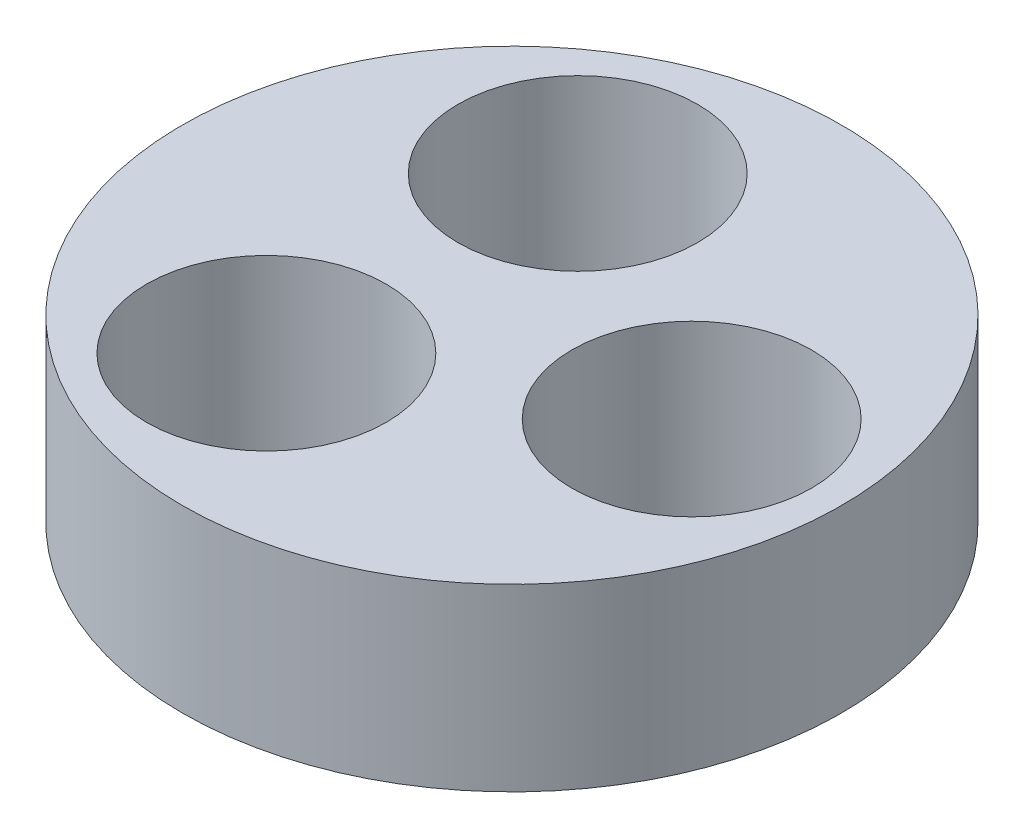
ISO-10303-21;
HEADER;
FILE_DESCRIPTION(('STEP AP214'),'2;1');
FILE_NAME('part.step','',(''),(''),'','','');
FILE_SCHEMA(('AUTOMOTIVE_DESIGN { 1 0 10303 214 1 1 1 1 }'));
ENDSEC;
DATA;
#1=APPLICATION_CONTEXT('core data for automotive mechanical design processes');
#2=APPLICATION_PROTOCOL_DEFINITION('international standard','automotive_design',2000,#1);
#3=PRODUCT_CONTEXT('',#1,'mechanical');
#4=PRODUCT('Part','Part','',(#3));
#5=PRODUCT_RELATED_PRODUCT_CATEGORY('part','',(#4));
#6=PRODUCT_DEFINITION_FORMATION('','',#4);
#7=PRODUCT_DEFINITION_CONTEXT('part definition',#1,'design');
#8=PRODUCT_DEFINITION('design','',#6,#7);
#9=PRODUCT_DEFINITION_SHAPE('','',#8);
#10=(LENGTH_UNIT() NAMED_UNIT(*) SI_UNIT(.MILLI.,.METRE.));
#11=(NAMED_UNIT(*) PLANE_ANGLE_UNIT() SI_UNIT($,.RADIAN.));
#12=(NAMED_UNIT(*) SI_UNIT($,.STERADIAN.) SOLID_ANGLE_UNIT());
#13=UNCERTAINTY_MEASURE_WITH_UNIT(LENGTH_MEASURE(1.E-05),#10,'distance_accuracy_value','');
#14=(GEOMETRIC_REPRESENTATION_CONTEXT(3) GLOBAL_UNCERTAINTY_ASSIGNED_CONTEXT((#13)) GLOBAL_UNIT_ASSIGNED_CONTEXT((#10,
#11,#12)) REPRESENTATION_CONTEXT('',''));
#15=CARTESIAN_POINT('',(0.,0.,0.));
#16=DIRECTION('',(0.,0.,1.));
#17=DIRECTION('',(1.,0.,0.));
#18=AXIS2_PLACEMENT_3D('',#15,#16,#17);
#19=CARTESIAN_POINT('',(2.,12.5,0.));
#20=DIRECTION('',(0.,1.,0.));
#21=DIRECTION('',(0.,0.,1.));
#22=AXIS2_PLACEMENT_3D('',#19,#20,#21);
#23=PLANE('',#22);
#24=CARTESIAN_POINT('',(0.499999999999988,12.5,2.59807621135331));
#25=DIRECTION('',(0.,1.,0.));
#26=DIRECTION('',(0.,0.,1.));
#27=AXIS2_PLACEMENT_3D('',#24,#25,#26);
#28=CIRCLE('',#27,2.);
#29=CARTESIAN_POINT('',(0.499999999999988,12.5,4.59807621135331));
#30=VERTEX_POINT('',#29);
#31=EDGE_CURVE('E51',#30,#30,#28,.T.);
#32=ORIENTED_EDGE('',*,*,#31,.F.);
#33=EDGE_LOOP('',(#32));
#34=FACE_BOUND('',#33,.T.);
#35=CARTESIAN_POINT('',(2.,12.5,0.));
#36=DIRECTION('',(0.,1.,0.));
#37=DIRECTION('',(0.,0.,1.));
#38=AXIS2_PLACEMENT_3D('',#35,#36,#37);
#39=CIRCLE('',#38,5.5);
#40=CARTESIAN_POINT('',(2.,12.5,5.5));
#41=VERTEX_POINT('',#40);
#42=EDGE_CURVE('E10',#41,#41,#39,.T.);
#43=ORIENTED_EDGE('',*,*,#42,.T.);
#44=EDGE_LOOP('',(#43));
#45=FACE_BOUND('',#44,.T.);
#46=CARTESIAN_POINT('',(5.,12.5,0.));
#47=DIRECTION('',(0.,1.,0.));
#48=DIRECTION('',(0.,0.,1.));
#49=AXIS2_PLACEMENT_3D('',#46,#47,#48);
#50=CIRCLE('',#49,2.);
#51=CARTESIAN_POINT('',(5.,12.5,2.));
#52=VERTEX_POINT('',#51);
#53=EDGE_CURVE('E46',#52,#52,#50,.T.);
#54=ORIENTED_EDGE('',*,*,#53,.F.);
#55=EDGE_LOOP('',(#54));
#56=FACE_BOUND('',#55,.T.);
#57=CARTESIAN_POINT('',(0.500000000000024,12.5,-2.59807621135333));
#58=DIRECTION('',(0.,1.,0.));
#59=DIRECTION('',(0.,0.,1.));
#60=AXIS2_PLACEMENT_3D('',#57,#58,#59);
#61=CIRCLE('',#60,2.);
#62=CARTESIAN_POINT('',(0.500000000000024,12.5,-0.598076211353332));
#63=VERTEX_POINT('',#62);
#64=EDGE_CURVE('E57',#63,#63,#61,.T.);
#65=ORIENTED_EDGE('',*,*,#64,.F.);
#66=EDGE_LOOP('',(#65));
#67=FACE_BOUND('',#66,.T.);
#68=ADVANCED_FACE('F35',(#34,#45,#56,#67),#23,.T.);
#69=CARTESIAN_POINT('',(2.,9.5,0.));
#70=DIRECTION('',(0.,1.,0.));
#71=DIRECTION('',(0.,0.,1.));
#72=AXIS2_PLACEMENT_3D('',#69,#70,#71);
#73=PLANE('',#72);
#74=CARTESIAN_POINT('',(2.,9.5,0.));
#75=DIRECTION('',(0.,1.,0.));
#76=DIRECTION('',(0.,0.,1.));
#77=AXIS2_PLACEMENT_3D('',#74,#75,#76);
#78=CIRCLE('',#77,5.5);
#79=CARTESIAN_POINT('',(2.,9.5,5.5));
#80=VERTEX_POINT('',#79);
#81=EDGE_CURVE('E39',#80,#80,#78,.T.);
#82=ORIENTED_EDGE('',*,*,#81,.F.);
#83=EDGE_LOOP('',(#82));
#84=FACE_BOUND('',#83,.T.);
#85=CARTESIAN_POINT('',(5.,9.5,0.));
#86=DIRECTION('',(0.,1.,0.));
#87=DIRECTION('',(0.,0.,1.));
#88=AXIS2_PLACEMENT_3D('',#85,#86,#87);
#89=CIRCLE('',#88,2.);
#90=CARTESIAN_POINT('',(5.,9.5,2.));
#91=VERTEX_POINT('',#90);
#92=EDGE_CURVE('E48',#91,#91,#89,.T.);
#93=ORIENTED_EDGE('',*,*,#92,.T.);
#94=EDGE_LOOP('',(#93));
#95=FACE_BOUND('',#94,.T.);
#96=CARTESIAN_POINT('',(0.499999999999988,9.5,2.59807621135331));
#97=DIRECTION('',(0.,1.,0.));
#98=DIRECTION('',(0.,0.,1.));
#99=AXIS2_PLACEMENT_3D('',#96,#97,#98);
#100=CIRCLE('',#99,2.);
#101=CARTESIAN_POINT('',(0.499999999999988,9.5,4.59807621135331));
#102=VERTEX_POINT('',#101);
#103=EDGE_CURVE('E54',#102,#102,#100,.T.);
#104=ORIENTED_EDGE('',*,*,#103,.T.);
#105=EDGE_LOOP('',(#104));
#106=FACE_BOUND('',#105,.T.);
#107=CARTESIAN_POINT('',(0.500000000000024,9.5,-2.59807621135333));
#108=DIRECTION('',(0.,1.,0.));
#109=DIRECTION('',(0.,0.,1.));
#110=AXIS2_PLACEMENT_3D('',#107,#108,#109);
#111=CIRCLE('',#110,2.);
#112=CARTESIAN_POINT('',(0.500000000000024,9.5,-0.598076211353332));
#113=VERTEX_POINT('',#112);
#114=EDGE_CURVE('E60',#113,#113,#111,.T.);
#115=ORIENTED_EDGE('',*,*,#114,.T.);
#116=EDGE_LOOP('',(#115));
#117=FACE_BOUND('',#116,.T.);
#118=ADVANCED_FACE('F70',(#84,#95,#106,#117),#73,.F.);
#119=CARTESIAN_POINT('',(2.,12.5,0.));
#120=DIRECTION('',(0.,-1.,0.));
#121=DIRECTION('',(0.,0.,-1.));
#122=AXIS2_PLACEMENT_3D('',#119,#120,#121);
#123=CYLINDRICAL_SURFACE('',#122,5.5);
#124=ORIENTED_EDGE('',*,*,#42,.F.);
#125=EDGE_LOOP('',(#124));
#126=FACE_BOUND('',#125,.T.);
#127=ORIENTED_EDGE('',*,*,#81,.T.);
#128=EDGE_LOOP('',(#127));
#129=FACE_BOUND('',#128,.T.);
#130=ADVANCED_FACE('F37',(#126,#129),#123,.T.);
#131=CARTESIAN_POINT('',(5.,12.5,0.));
#132=DIRECTION('',(0.,-1.,0.));
#133=DIRECTION('',(0.,0.,-1.));
#134=AXIS2_PLACEMENT_3D('',#131,#132,#133);
#135=CYLINDRICAL_SURFACE('',#134,2.);
#136=ORIENTED_EDGE('',*,*,#53,.T.);
#137=EDGE_LOOP('',(#136));
#138=FACE_BOUND('',#137,.T.);
#139=ORIENTED_EDGE('',*,*,#92,.F.);
#140=EDGE_LOOP('',(#139));
#141=FACE_BOUND('',#140,.T.);
#142=ADVANCED_FACE('F79',(#138,#141),#135,.F.);
#143=CARTESIAN_POINT('',(0.499999999999988,12.5,2.59807621135331));
#144=DIRECTION('',(0.,-1.,0.));
#145=DIRECTION('',(0.,0.,-1.));
#146=AXIS2_PLACEMENT_3D('',#143,#144,#145);
#147=CYLINDRICAL_SURFACE('',#146,2.);
#148=ORIENTED_EDGE('',*,*,#31,.T.);
#149=EDGE_LOOP('',(#148));
#150=FACE_BOUND('',#149,.T.);
#151=ORIENTED_EDGE('',*,*,#103,.F.);
#152=EDGE_LOOP('',(#151));
#153=FACE_BOUND('',#152,.T.);
#154=ADVANCED_FACE('F82',(#150,#153),#147,.F.);
#155=CARTESIAN_POINT('',(0.500000000000024,12.5,-2.59807621135333));
#156=DIRECTION('',(0.,-1.,0.));
#157=DIRECTION('',(0.,0.,-1.));
#158=AXIS2_PLACEMENT_3D('',#155,#156,#157);
#159=CYLINDRICAL_SURFACE('',#158,2.);
#160=ORIENTED_EDGE('',*,*,#64,.T.);
#161=EDGE_LOOP('',(#160));
#162=FACE_BOUND('',#161,.T.);
#163=ORIENTED_EDGE('',*,*,#114,.F.);
#164=EDGE_LOOP('',(#163));
#165=FACE_BOUND('',#164,.T.);
#166=ADVANCED_FACE('F66',(#162,#165),#159,.F.);
#167=CLOSED_SHELL('',(#68,#118,#130,#142,#154,#166));
#168=MANIFOLD_SOLID_BREP('B2',#167);
#169=ADVANCED_BREP_SHAPE_REPRESENTATION('',(#18,#168),#14);
#170=SHAPE_DEFINITION_REPRESENTATION(#9,#169);
ENDSEC;
END-ISO-10303-21;
